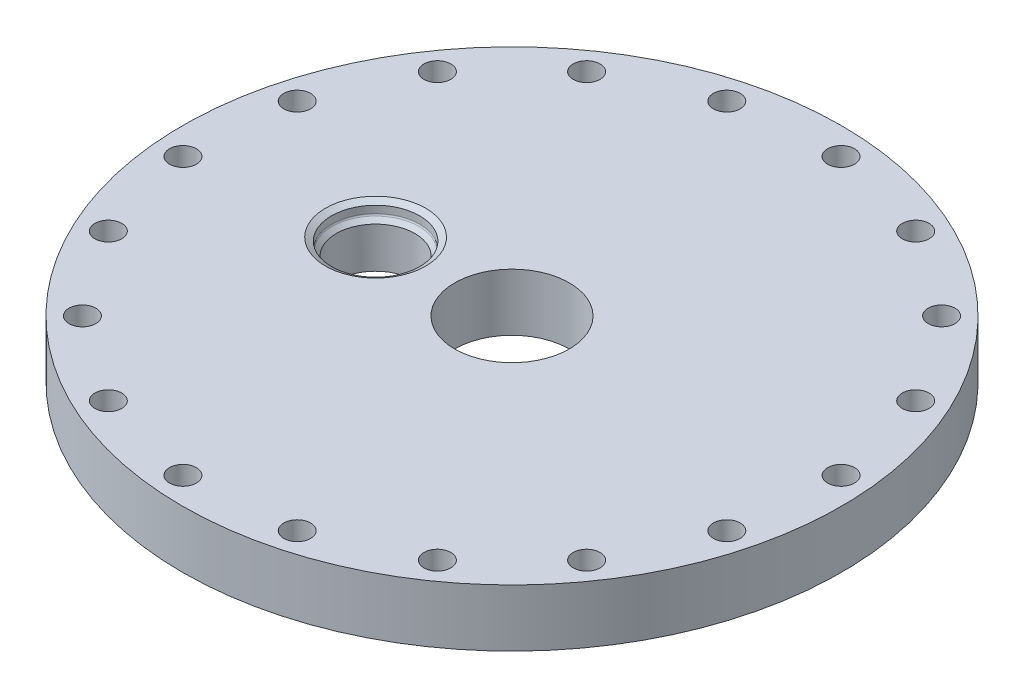
ISO-10303-21;
HEADER;
FILE_DESCRIPTION(('STEP AP214'),'2;1');
FILE_NAME('part.step','',(''),(''),'','','');
FILE_SCHEMA(('AUTOMOTIVE_DESIGN { 1 0 10303 214 1 1 1 1 }'));
ENDSEC;
DATA;
#1=APPLICATION_CONTEXT('core data for automotive mechanical design processes');
#2=APPLICATION_PROTOCOL_DEFINITION('international standard','automotive_design',2000,#1);
#3=PRODUCT_CONTEXT('',#1,'mechanical');
#4=PRODUCT('Part','Part','',(#3));
#5=PRODUCT_RELATED_PRODUCT_CATEGORY('part','',(#4));
#6=PRODUCT_DEFINITION_FORMATION('','',#4);
#7=PRODUCT_DEFINITION_CONTEXT('part definition',#1,'design');
#8=PRODUCT_DEFINITION('design','',#6,#7);
#9=PRODUCT_DEFINITION_SHAPE('','',#8);
#10=(LENGTH_UNIT() NAMED_UNIT(*) SI_UNIT(.MILLI.,.METRE.));
#11=(NAMED_UNIT(*) PLANE_ANGLE_UNIT() SI_UNIT($,.RADIAN.));
#12=(NAMED_UNIT(*) SI_UNIT($,.STERADIAN.) SOLID_ANGLE_UNIT());
#13=UNCERTAINTY_MEASURE_WITH_UNIT(LENGTH_MEASURE(1.E-05),#10,'distance_accuracy_value','');
#14=(GEOMETRIC_REPRESENTATION_CONTEXT(3) GLOBAL_UNCERTAINTY_ASSIGNED_CONTEXT((#13)) GLOBAL_UNIT_ASSIGNED_CONTEXT((#10,
#11,#12)) REPRESENTATION_CONTEXT('',''));
#15=CARTESIAN_POINT('',(0.,0.,0.));
#16=DIRECTION('',(0.,0.,1.));
#17=DIRECTION('',(1.,0.,0.));
#18=AXIS2_PLACEMENT_3D('',#15,#16,#17);
#19=CARTESIAN_POINT('',(-30.226,-0.000999999999999265,0.));
#20=DIRECTION('',(0.,1.,0.));
#21=DIRECTION('',(0.,0.,1.));
#22=AXIS2_PLACEMENT_3D('',#19,#20,#21);
#23=CYLINDRICAL_SURFACE('',#22,8.71220000000001);
#24=CARTESIAN_POINT('',(-30.226,0.,0.));
#25=DIRECTION('',(0.,1.,0.));
#26=DIRECTION('',(0.,0.,1.));
#27=AXIS2_PLACEMENT_3D('',#24,#25,#26);
#28=CIRCLE('',#27,8.71220000000001);
#29=CARTESIAN_POINT('',(-30.226,0.,8.71220000000001));
#30=VERTEX_POINT('',#29);
#31=EDGE_CURVE('E177',#30,#30,#28,.F.);
#32=ORIENTED_EDGE('',*,*,#31,.T.);
#33=EDGE_LOOP('',(#32));
#34=FACE_BOUND('',#33,.T.);
#35=CARTESIAN_POINT('',(-30.226,9.04787951031445,0.));
#36=DIRECTION('',(0.,-1.,0.));
#37=DIRECTION('',(0.,0.,-1.));
#38=AXIS2_PLACEMENT_3D('',#35,#36,#37);
#39=CIRCLE('',#38,8.71219999999999);
#40=CARTESIAN_POINT('',(-30.226,9.04787951031445,-8.71219999999999));
#41=VERTEX_POINT('',#40);
#42=EDGE_CURVE('E180',#41,#41,#39,.T.);
#43=ORIENTED_EDGE('',*,*,#42,.F.);
#44=EDGE_LOOP('',(#43));
#45=FACE_BOUND('',#44,.T.);
#46=ADVANCED_FACE('F41',(#34,#45),#23,.F.);
#47=CARTESIAN_POINT('',(0.,12.7,0.));
#48=DIRECTION('',(0.,-1.,0.));
#49=DIRECTION('',(0.,0.,-1.));
#50=AXIS2_PLACEMENT_3D('',#47,#48,#49);
#51=CYLINDRICAL_SURFACE('',#50,73.025);
#52=CARTESIAN_POINT('',(0.,12.7,0.));
#53=DIRECTION('',(0.,1.,0.));
#54=DIRECTION('',(0.,0.,1.));
#55=AXIS2_PLACEMENT_3D('',#52,#53,#54);
#56=CIRCLE('',#55,73.025);
#57=CARTESIAN_POINT('',(0.,12.7,73.025));
#58=VERTEX_POINT('',#57);
#59=EDGE_CURVE('E10',#58,#58,#56,.T.);
#60=ORIENTED_EDGE('',*,*,#59,.F.);
#61=EDGE_LOOP('',(#60));
#62=FACE_BOUND('',#61,.T.);
#63=CARTESIAN_POINT('',(0.,0.,0.));
#64=DIRECTION('',(0.,1.,0.));
#65=DIRECTION('',(0.,0.,1.));
#66=AXIS2_PLACEMENT_3D('',#63,#64,#65);
#67=CIRCLE('',#66,73.025);
#68=CARTESIAN_POINT('',(0.,0.,73.025));
#69=VERTEX_POINT('',#68);
#70=EDGE_CURVE('E45',#69,#69,#67,.T.);
#71=ORIENTED_EDGE('',*,*,#70,.T.);
#72=EDGE_LOOP('',(#71));
#73=FACE_BOUND('',#72,.T.);
#74=ADVANCED_FACE('F43',(#62,#73),#51,.T.);
#75=CARTESIAN_POINT('',(0.,12.7,0.));
#76=DIRECTION('',(0.,1.,0.));
#77=DIRECTION('',(0.,0.,1.));
#78=AXIS2_PLACEMENT_3D('',#75,#76,#77);
#79=PLANE('',#78);
#80=CARTESIAN_POINT('',(-30.226,12.7,0.));
#81=DIRECTION('',(0.,-1.,0.));
#82=DIRECTION('',(0.,0.,-1.));
#83=AXIS2_PLACEMENT_3D('',#80,#81,#82);
#84=CIRCLE('',#83,11.1125);
#85=CARTESIAN_POINT('',(-30.226,12.7,-11.1125));
#86=VERTEX_POINT('',#85);
#87=EDGE_CURVE('E192',#86,#86,#84,.T.);
#88=ORIENTED_EDGE('',*,*,#87,.T.);
#89=EDGE_LOOP('',(#88));
#90=FACE_BOUND('',#89,.T.);
#91=CARTESIAN_POINT('',(-67.0538651285555,12.7,5.86645304434398));
#92=DIRECTION('',(0.,1.,0.));
#93=DIRECTION('',(0.342020143325657,0.,0.939692620785913));
#94=AXIS2_PLACEMENT_3D('',#91,#92,#93);
#95=CIRCLE('',#94,2.97688);
#96=CARTESIAN_POINT('',(-66.0357122042922,12.7,8.66380521330915));
#97=VERTEX_POINT('',#96);
#98=EDGE_CURVE('E174',#97,#97,#95,.T.);
#99=ORIENTED_EDGE('',*,*,#98,.F.);
#100=EDGE_LOOP('',(#99));
#101=FACE_BOUND('',#100,.T.);
#102=CARTESIAN_POINT('',(-61.0035771454373,12.7,28.4464351977657));
#103=DIRECTION('',(0.,1.,0.));
#104=DIRECTION('',(0.64278760968653,0.,0.766044443118986));
#105=AXIS2_PLACEMENT_3D('',#102,#103,#104);
#106=CIRCLE('',#105,2.97688);
#107=CARTESIAN_POINT('',(-59.0900755659137,12.7,30.7268575795978));
#108=VERTEX_POINT('',#107);
#109=EDGE_CURVE('E166',#108,#108,#106,.T.);
#110=ORIENTED_EDGE('',*,*,#109,.F.);
#111=EDGE_LOOP('',(#110));
#112=FACE_BOUND('',#111,.T.);
#113=CARTESIAN_POINT('',(-47.5953574416671,12.7,47.5953574416659));
#114=DIRECTION('',(0.,1.,0.));
#115=DIRECTION('',(0.866025403784433,0.,0.50000000000001));
#116=AXIS2_PLACEMENT_3D('',#113,#114,#115);
#117=CIRCLE('',#116,2.97688);
#118=CARTESIAN_POINT('',(-45.0173037376493,12.7,49.083797441666));
#119=VERTEX_POINT('',#118);
#120=EDGE_CURVE('E159',#119,#119,#117,.T.);
#121=ORIENTED_EDGE('',*,*,#120,.F.);
#122=EDGE_LOOP('',(#121));
#123=FACE_BOUND('',#122,.T.);
#124=CARTESIAN_POINT('',(-28.4464351977671,12.7,61.0035771454366));
#125=DIRECTION('',(0.,1.,0.));
#126=DIRECTION('',(0.984807753012206,0.,0.17364817766694));
#127=AXIS2_PLACEMENT_3D('',#124,#125,#126);
#128=CIRCLE('',#127,2.97688);
#129=CARTESIAN_POINT('',(-25.5147806939802,12.7,61.5205069325698));
#130=VERTEX_POINT('',#129);
#131=EDGE_CURVE('E152',#130,#130,#128,.T.);
#132=ORIENTED_EDGE('',*,*,#131,.F.);
#133=EDGE_LOOP('',(#132));
#134=FACE_BOUND('',#133,.T.);
#135=CARTESIAN_POINT('',(-5.86645304434557,12.7,67.0538651285553));
#136=DIRECTION('',(0.,1.,0.));
#137=DIRECTION('',(0.98480775301221,0.,-0.173648177666921));
#138=AXIS2_PLACEMENT_3D('',#135,#136,#137);
#139=CIRCLE('',#138,2.97688);
#140=CARTESIAN_POINT('',(-2.93479854055859,12.7,66.5369353414222));
#141=VERTEX_POINT('',#140);
#142=EDGE_CURVE('E146',#141,#141,#139,.T.);
#143=ORIENTED_EDGE('',*,*,#142,.F.);
#144=EDGE_LOOP('',(#143));
#145=FACE_BOUND('',#144,.T.);
#146=CARTESIAN_POINT('',(17.42110992585,12.7,65.0164673675174));
#147=DIRECTION('',(0.,1.,0.));
#148=DIRECTION('',(0.866025403784443,0.,-0.499999999999992));
#149=AXIS2_PLACEMENT_3D('',#146,#147,#148);
#150=CIRCLE('',#149,2.97688);
#151=CARTESIAN_POINT('',(19.9991636298679,12.7,63.5280273675174));
#152=VERTEX_POINT('',#151);
#153=EDGE_CURVE('E140',#152,#152,#150,.T.);
#154=ORIENTED_EDGE('',*,*,#153,.F.);
#155=EDGE_LOOP('',(#154));
#156=FACE_BOUND('',#155,.T.);
#157=CARTESIAN_POINT('',(38.6074299307884,12.7,55.1371241010924));
#158=DIRECTION('',(0.,1.,0.));
#159=DIRECTION('',(0.642787609686546,0.,-0.766044443118973));
#160=AXIS2_PLACEMENT_3D('',#157,#158,#159);
#161=CIRCLE('',#160,2.97688);
#162=CARTESIAN_POINT('',(40.5209315103121,12.7,52.8567017192604));
#163=VERTEX_POINT('',#162);
#164=EDGE_CURVE('E134',#163,#163,#161,.T.);
#165=ORIENTED_EDGE('',*,*,#164,.F.);
#166=EDGE_LOOP('',(#165));
#167=FACE_BOUND('',#166,.T.);
#168=CARTESIAN_POINT('',(55.1371241010917,12.7,38.6074299307894));
#169=DIRECTION('',(0.,1.,0.));
#170=DIRECTION('',(0.342020143325676,0.,-0.939692620785906));
#171=AXIS2_PLACEMENT_3D('',#168,#169,#170);
#172=CIRCLE('',#171,2.97688);
#173=CARTESIAN_POINT('',(56.1552770253551,12.7,35.8100777618242));
#174=VERTEX_POINT('',#173);
#175=EDGE_CURVE('E128',#174,#174,#172,.T.);
#176=ORIENTED_EDGE('',*,*,#175,.F.);
#177=EDGE_LOOP('',(#176));
#178=FACE_BOUND('',#177,.T.);
#179=CARTESIAN_POINT('',(65.0164673675171,12.7,17.4211099258512));
#180=DIRECTION('',(0.,1.,0.));
#181=DIRECTION('',(0.,0.,-1.));
#182=AXIS2_PLACEMENT_3D('',#179,#180,#181);
#183=CIRCLE('',#182,2.97688);
#184=CARTESIAN_POINT('',(65.0164673675171,12.7,14.4442299258512));
#185=VERTEX_POINT('',#184);
#186=EDGE_CURVE('E122',#185,#185,#183,.T.);
#187=ORIENTED_EDGE('',*,*,#186,.F.);
#188=EDGE_LOOP('',(#187));
#189=FACE_BOUND('',#188,.T.);
#190=CARTESIAN_POINT('',(67.0538651285554,12.7,-5.86645304434442));
#191=DIRECTION('',(0.,1.,0.));
#192=DIRECTION('',(-0.342020143325663,0.,-0.939692620785911));
#193=AXIS2_PLACEMENT_3D('',#190,#191,#192);
#194=CIRCLE('',#193,2.97688);
#195=CARTESIAN_POINT('',(66.0357122042922,12.7,-8.66380521330959));
#196=VERTEX_POINT('',#195);
#197=EDGE_CURVE('E116',#196,#196,#194,.T.);
#198=ORIENTED_EDGE('',*,*,#197,.F.);
#199=EDGE_LOOP('',(#198));
#200=FACE_BOUND('',#199,.T.);
#201=CARTESIAN_POINT('',(61.0035771454371,12.7,-28.4464351977661));
#202=DIRECTION('',(0.,1.,0.));
#203=DIRECTION('',(-0.642787609686535,0.,-0.766044443118981));
#204=AXIS2_PLACEMENT_3D('',#201,#202,#203);
#205=CIRCLE('',#204,2.97688);
#206=CARTESIAN_POINT('',(59.0900755659134,12.7,-30.7268575795982));
#207=VERTEX_POINT('',#206);
#208=EDGE_CURVE('E110',#207,#207,#205,.T.);
#209=ORIENTED_EDGE('',*,*,#208,.F.);
#210=EDGE_LOOP('',(#209));
#211=FACE_BOUND('',#210,.T.);
#212=CARTESIAN_POINT('',(47.5953574416668,12.7,-47.5953574416663));
#213=DIRECTION('',(0.,1.,0.));
#214=DIRECTION('',(-0.866025403784436,0.,-0.500000000000004));
#215=AXIS2_PLACEMENT_3D('',#212,#213,#214);
#216=CIRCLE('',#215,2.97688);
#217=CARTESIAN_POINT('',(45.017303737649,12.7,-49.0837974416663));
#218=VERTEX_POINT('',#217);
#219=EDGE_CURVE('E104',#218,#218,#216,.T.);
#220=ORIENTED_EDGE('',*,*,#219,.F.);
#221=EDGE_LOOP('',(#220));
#222=FACE_BOUND('',#221,.T.);
#223=CARTESIAN_POINT('',(28.4464351977667,12.7,-61.0035771454368));
#224=DIRECTION('',(0.,1.,0.));
#225=DIRECTION('',(-0.984807753012207,0.,-0.173648177666934));
#226=AXIS2_PLACEMENT_3D('',#223,#224,#225);
#227=CIRCLE('',#226,2.97688);
#228=CARTESIAN_POINT('',(25.5147806939798,12.7,-61.5205069325699));
#229=VERTEX_POINT('',#228);
#230=EDGE_CURVE('E98',#229,#229,#227,.T.);
#231=ORIENTED_EDGE('',*,*,#230,.F.);
#232=EDGE_LOOP('',(#231));
#233=FACE_BOUND('',#232,.T.);
#234=CARTESIAN_POINT('',(5.86645304434512,12.7,-67.0538651285554));
#235=DIRECTION('',(0.,1.,0.));
#236=DIRECTION('',(-0.984807753012209,0.,0.173648177666927));
#237=AXIS2_PLACEMENT_3D('',#234,#235,#236);
#238=CIRCLE('',#237,2.97688);
#239=CARTESIAN_POINT('',(2.93479854055814,12.7,-66.5369353414223));
#240=VERTEX_POINT('',#239);
#241=EDGE_CURVE('E92',#240,#240,#238,.T.);
#242=ORIENTED_EDGE('',*,*,#241,.F.);
#243=EDGE_LOOP('',(#242));
#244=FACE_BOUND('',#243,.T.);
#245=CARTESIAN_POINT('',(-17.4211099258505,12.7,-65.0164673675173));
#246=DIRECTION('',(0.,1.,0.));
#247=DIRECTION('',(-0.86602540378444,0.,0.499999999999998));
#248=AXIS2_PLACEMENT_3D('',#245,#246,#247);
#249=CIRCLE('',#248,2.97688);
#250=CARTESIAN_POINT('',(-19.9991636298683,12.7,-63.5280273675173));
#251=VERTEX_POINT('',#250);
#252=EDGE_CURVE('E86',#251,#251,#249,.T.);
#253=ORIENTED_EDGE('',*,*,#252,.F.);
#254=EDGE_LOOP('',(#253));
#255=FACE_BOUND('',#254,.T.);
#256=CARTESIAN_POINT('',(-38.6074299307888,12.7,-55.1371241010921));
#257=DIRECTION('',(0.,1.,0.));
#258=DIRECTION('',(-0.642787609686541,0.,0.766044443118977));
#259=AXIS2_PLACEMENT_3D('',#256,#257,#258);
#260=CIRCLE('',#259,2.97688);
#261=CARTESIAN_POINT('',(-40.5209315103125,12.7,-52.8567017192601));
#262=VERTEX_POINT('',#261);
#263=EDGE_CURVE('E80',#262,#262,#260,.T.);
#264=ORIENTED_EDGE('',*,*,#263,.F.);
#265=EDGE_LOOP('',(#264));
#266=FACE_BOUND('',#265,.T.);
#267=CARTESIAN_POINT('',(-55.137124101092,12.7,-38.607429930789));
#268=DIRECTION('',(0.,1.,0.));
#269=DIRECTION('',(-0.342020143325669,0.,0.939692620785908));
#270=AXIS2_PLACEMENT_3D('',#267,#268,#269);
#271=CIRCLE('',#270,2.97688);
#272=CARTESIAN_POINT('',(-56.1552770253553,12.7,-35.8100777618238));
#273=VERTEX_POINT('',#272);
#274=EDGE_CURVE('E74',#273,#273,#271,.T.);
#275=ORIENTED_EDGE('',*,*,#274,.F.);
#276=EDGE_LOOP('',(#275));
#277=FACE_BOUND('',#276,.T.);
#278=CARTESIAN_POINT('',(-65.0164673675172,12.7,-17.4211099258507));
#279=DIRECTION('',(0.,1.,0.));
#280=DIRECTION('',(0.,0.,1.));
#281=AXIS2_PLACEMENT_3D('',#278,#279,#280);
#282=CIRCLE('',#281,2.97688);
#283=CARTESIAN_POINT('',(-65.0164673675172,12.7,-14.4442299258507));
#284=VERTEX_POINT('',#283);
#285=EDGE_CURVE('E68',#284,#284,#282,.T.);
#286=ORIENTED_EDGE('',*,*,#285,.F.);
#287=EDGE_LOOP('',(#286));
#288=FACE_BOUND('',#287,.T.);
#289=CARTESIAN_POINT('',(0.,12.7,0.));
#290=DIRECTION('',(0.,1.,0.));
#291=DIRECTION('',(0.,0.,1.));
#292=AXIS2_PLACEMENT_3D('',#289,#290,#291);
#293=CIRCLE('',#292,12.7);
#294=CARTESIAN_POINT('',(0.,12.7,12.7));
#295=VERTEX_POINT('',#294);
#296=EDGE_CURVE('E58',#295,#295,#293,.T.);
#297=ORIENTED_EDGE('',*,*,#296,.F.);
#298=EDGE_LOOP('',(#297));
#299=FACE_BOUND('',#298,.T.);
#300=ORIENTED_EDGE('',*,*,#59,.T.);
#301=EDGE_LOOP('',(#300));
#302=FACE_BOUND('',#301,.T.);
#303=ADVANCED_FACE('F197',(#90,#101,#112,#123,#134,#145,#156,#167,#178,#189,#200,#211,#222,#233,
#244,#255,#266,#277,#288,#299,#302),#79,.T.);
#304=CARTESIAN_POINT('',(0.,0.,0.));
#305=DIRECTION('',(0.,1.,0.));
#306=DIRECTION('',(0.,0.,1.));
#307=AXIS2_PLACEMENT_3D('',#304,#305,#306);
#308=PLANE('',#307);
#309=ORIENTED_EDGE('',*,*,#31,.F.);
#310=EDGE_LOOP('',(#309));
#311=FACE_BOUND('',#310,.T.);
#312=CARTESIAN_POINT('',(-67.0538651285555,0.,5.86645304434398));
#313=DIRECTION('',(0.,1.,0.));
#314=DIRECTION('',(0.,0.,1.));
#315=AXIS2_PLACEMENT_3D('',#312,#313,#314);
#316=CIRCLE('',#315,2.97688);
#317=CARTESIAN_POINT('',(-67.0538651285555,0.,8.84333304434399));
#318=VERTEX_POINT('',#317);
#319=EDGE_CURVE('E170',#318,#318,#316,.F.);
#320=ORIENTED_EDGE('',*,*,#319,.F.);
#321=EDGE_LOOP('',(#320));
#322=FACE_BOUND('',#321,.T.);
#323=CARTESIAN_POINT('',(-61.0035771454373,0.,28.4464351977657));
#324=DIRECTION('',(0.,1.,0.));
#325=DIRECTION('',(0.,0.,1.));
#326=AXIS2_PLACEMENT_3D('',#323,#324,#325);
#327=CIRCLE('',#326,2.97688);
#328=CARTESIAN_POINT('',(-61.0035771454373,0.,31.4233151977657));
#329=VERTEX_POINT('',#328);
#330=EDGE_CURVE('E163',#329,#329,#327,.F.);
#331=ORIENTED_EDGE('',*,*,#330,.F.);
#332=EDGE_LOOP('',(#331));
#333=FACE_BOUND('',#332,.T.);
#334=CARTESIAN_POINT('',(-47.5953574416671,0.,47.5953574416659));
#335=DIRECTION('',(0.,1.,0.));
#336=DIRECTION('',(0.,0.,1.));
#337=AXIS2_PLACEMENT_3D('',#334,#335,#336);
#338=CIRCLE('',#337,2.97688);
#339=CARTESIAN_POINT('',(-47.5953574416671,0.,50.5722374416659));
#340=VERTEX_POINT('',#339);
#341=EDGE_CURVE('E155',#340,#340,#338,.F.);
#342=ORIENTED_EDGE('',*,*,#341,.F.);
#343=EDGE_LOOP('',(#342));
#344=FACE_BOUND('',#343,.T.);
#345=CARTESIAN_POINT('',(-28.4464351977671,0.,61.0035771454366));
#346=DIRECTION('',(0.,1.,0.));
#347=DIRECTION('',(0.,0.,1.));
#348=AXIS2_PLACEMENT_3D('',#345,#346,#347);
#349=CIRCLE('',#348,2.97688);
#350=CARTESIAN_POINT('',(-28.4464351977671,0.,63.9804571454366));
#351=VERTEX_POINT('',#350);
#352=EDGE_CURVE('E149',#351,#351,#349,.F.);
#353=ORIENTED_EDGE('',*,*,#352,.F.);
#354=EDGE_LOOP('',(#353));
#355=FACE_BOUND('',#354,.T.);
#356=CARTESIAN_POINT('',(-5.86645304434557,0.,67.0538651285553));
#357=DIRECTION('',(0.,1.,0.));
#358=DIRECTION('',(0.,0.,1.));
#359=AXIS2_PLACEMENT_3D('',#356,#357,#358);
#360=CIRCLE('',#359,2.97688);
#361=CARTESIAN_POINT('',(-5.86645304434557,0.,70.0307451285553));
#362=VERTEX_POINT('',#361);
#363=EDGE_CURVE('E143',#362,#362,#360,.F.);
#364=ORIENTED_EDGE('',*,*,#363,.F.);
#365=EDGE_LOOP('',(#364));
#366=FACE_BOUND('',#365,.T.);
#367=CARTESIAN_POINT('',(17.42110992585,0.,65.0164673675174));
#368=DIRECTION('',(0.,1.,0.));
#369=DIRECTION('',(0.,0.,1.));
#370=AXIS2_PLACEMENT_3D('',#367,#368,#369);
#371=CIRCLE('',#370,2.97688);
#372=CARTESIAN_POINT('',(17.42110992585,0.,67.9933473675174));
#373=VERTEX_POINT('',#372);
#374=EDGE_CURVE('E137',#373,#373,#371,.F.);
#375=ORIENTED_EDGE('',*,*,#374,.F.);
#376=EDGE_LOOP('',(#375));
#377=FACE_BOUND('',#376,.T.);
#378=CARTESIAN_POINT('',(38.6074299307884,0.,55.1371241010924));
#379=DIRECTION('',(0.,1.,0.));
#380=DIRECTION('',(0.,0.,1.));
#381=AXIS2_PLACEMENT_3D('',#378,#379,#380);
#382=CIRCLE('',#381,2.97688);
#383=CARTESIAN_POINT('',(38.6074299307884,0.,58.1140041010924));
#384=VERTEX_POINT('',#383);
#385=EDGE_CURVE('E131',#384,#384,#382,.F.);
#386=ORIENTED_EDGE('',*,*,#385,.F.);
#387=EDGE_LOOP('',(#386));
#388=FACE_BOUND('',#387,.T.);
#389=CARTESIAN_POINT('',(55.1371241010917,0.,38.6074299307894));
#390=DIRECTION('',(0.,1.,0.));
#391=DIRECTION('',(0.,0.,1.));
#392=AXIS2_PLACEMENT_3D('',#389,#390,#391);
#393=CIRCLE('',#392,2.97688);
#394=CARTESIAN_POINT('',(55.1371241010917,0.,41.5843099307894));
#395=VERTEX_POINT('',#394);
#396=EDGE_CURVE('E125',#395,#395,#393,.F.);
#397=ORIENTED_EDGE('',*,*,#396,.F.);
#398=EDGE_LOOP('',(#397));
#399=FACE_BOUND('',#398,.T.);
#400=CARTESIAN_POINT('',(65.0164673675171,0.,17.4211099258512));
#401=DIRECTION('',(0.,1.,0.));
#402=DIRECTION('',(0.,0.,1.));
#403=AXIS2_PLACEMENT_3D('',#400,#401,#402);
#404=CIRCLE('',#403,2.97688);
#405=CARTESIAN_POINT('',(65.0164673675171,0.,20.3979899258512));
#406=VERTEX_POINT('',#405);
#407=EDGE_CURVE('E119',#406,#406,#404,.F.);
#408=ORIENTED_EDGE('',*,*,#407,.F.);
#409=EDGE_LOOP('',(#408));
#410=FACE_BOUND('',#409,.T.);
#411=CARTESIAN_POINT('',(67.0538651285554,0.,-5.86645304434442));
#412=DIRECTION('',(0.,1.,0.));
#413=DIRECTION('',(0.,0.,1.));
#414=AXIS2_PLACEMENT_3D('',#411,#412,#413);
#415=CIRCLE('',#414,2.97688);
#416=CARTESIAN_POINT('',(67.0538651285554,0.,-2.88957304434442));
#417=VERTEX_POINT('',#416);
#418=EDGE_CURVE('E113',#417,#417,#415,.F.);
#419=ORIENTED_EDGE('',*,*,#418,.F.);
#420=EDGE_LOOP('',(#419));
#421=FACE_BOUND('',#420,.T.);
#422=CARTESIAN_POINT('',(61.0035771454371,0.,-28.4464351977661));
#423=DIRECTION('',(0.,1.,0.));
#424=DIRECTION('',(0.,0.,1.));
#425=AXIS2_PLACEMENT_3D('',#422,#423,#424);
#426=CIRCLE('',#425,2.97688);
#427=CARTESIAN_POINT('',(61.0035771454371,0.,-25.4695551977661));
#428=VERTEX_POINT('',#427);
#429=EDGE_CURVE('E107',#428,#428,#426,.F.);
#430=ORIENTED_EDGE('',*,*,#429,.F.);
#431=EDGE_LOOP('',(#430));
#432=FACE_BOUND('',#431,.T.);
#433=CARTESIAN_POINT('',(47.5953574416668,0.,-47.5953574416663));
#434=DIRECTION('',(0.,1.,0.));
#435=DIRECTION('',(0.,0.,1.));
#436=AXIS2_PLACEMENT_3D('',#433,#434,#435);
#437=CIRCLE('',#436,2.97688);
#438=CARTESIAN_POINT('',(47.5953574416668,0.,-44.6184774416663));
#439=VERTEX_POINT('',#438);
#440=EDGE_CURVE('E101',#439,#439,#437,.F.);
#441=ORIENTED_EDGE('',*,*,#440,.F.);
#442=EDGE_LOOP('',(#441));
#443=FACE_BOUND('',#442,.T.);
#444=CARTESIAN_POINT('',(28.4464351977667,0.,-61.0035771454368));
#445=DIRECTION('',(0.,1.,0.));
#446=DIRECTION('',(0.,0.,1.));
#447=AXIS2_PLACEMENT_3D('',#444,#445,#446);
#448=CIRCLE('',#447,2.97688);
#449=CARTESIAN_POINT('',(28.4464351977667,0.,-58.0266971454368));
#450=VERTEX_POINT('',#449);
#451=EDGE_CURVE('E95',#450,#450,#448,.F.);
#452=ORIENTED_EDGE('',*,*,#451,.F.);
#453=EDGE_LOOP('',(#452));
#454=FACE_BOUND('',#453,.T.);
#455=CARTESIAN_POINT('',(5.86645304434512,0.,-67.0538651285554));
#456=DIRECTION('',(0.,1.,0.));
#457=DIRECTION('',(0.,0.,1.));
#458=AXIS2_PLACEMENT_3D('',#455,#456,#457);
#459=CIRCLE('',#458,2.97688);
#460=CARTESIAN_POINT('',(5.86645304434512,0.,-64.0769851285554));
#461=VERTEX_POINT('',#460);
#462=EDGE_CURVE('E89',#461,#461,#459,.F.);
#463=ORIENTED_EDGE('',*,*,#462,.F.);
#464=EDGE_LOOP('',(#463));
#465=FACE_BOUND('',#464,.T.);
#466=CARTESIAN_POINT('',(-17.4211099258505,0.,-65.0164673675173));
#467=DIRECTION('',(0.,1.,0.));
#468=DIRECTION('',(0.,0.,1.));
#469=AXIS2_PLACEMENT_3D('',#466,#467,#468);
#470=CIRCLE('',#469,2.97688);
#471=CARTESIAN_POINT('',(-17.4211099258505,0.,-62.0395873675172));
#472=VERTEX_POINT('',#471);
#473=EDGE_CURVE('E83',#472,#472,#470,.F.);
#474=ORIENTED_EDGE('',*,*,#473,.F.);
#475=EDGE_LOOP('',(#474));
#476=FACE_BOUND('',#475,.T.);
#477=CARTESIAN_POINT('',(-38.6074299307888,0.,-55.1371241010921));
#478=DIRECTION('',(0.,1.,0.));
#479=DIRECTION('',(0.,0.,1.));
#480=AXIS2_PLACEMENT_3D('',#477,#478,#479);
#481=CIRCLE('',#480,2.97688);
#482=CARTESIAN_POINT('',(-38.6074299307888,0.,-52.1602441010921));
#483=VERTEX_POINT('',#482);
#484=EDGE_CURVE('E77',#483,#483,#481,.F.);
#485=ORIENTED_EDGE('',*,*,#484,.F.);
#486=EDGE_LOOP('',(#485));
#487=FACE_BOUND('',#486,.T.);
#488=CARTESIAN_POINT('',(-55.137124101092,0.,-38.607429930789));
#489=DIRECTION('',(0.,1.,0.));
#490=DIRECTION('',(0.,0.,1.));
#491=AXIS2_PLACEMENT_3D('',#488,#489,#490);
#492=CIRCLE('',#491,2.97688);
#493=CARTESIAN_POINT('',(-55.137124101092,0.,-35.630549930789));
#494=VERTEX_POINT('',#493);
#495=EDGE_CURVE('E71',#494,#494,#492,.F.);
#496=ORIENTED_EDGE('',*,*,#495,.F.);
#497=EDGE_LOOP('',(#496));
#498=FACE_BOUND('',#497,.T.);
#499=CARTESIAN_POINT('',(-65.0164673675172,0.,-17.4211099258507));
#500=DIRECTION('',(0.,1.,0.));
#501=DIRECTION('',(0.,0.,1.));
#502=AXIS2_PLACEMENT_3D('',#499,#500,#501);
#503=CIRCLE('',#502,2.97688);
#504=CARTESIAN_POINT('',(-65.0164673675172,0.,-14.4442299258507));
#505=VERTEX_POINT('',#504);
#506=EDGE_CURVE('E62',#505,#505,#503,.F.);
#507=ORIENTED_EDGE('',*,*,#506,.F.);
#508=EDGE_LOOP('',(#507));
#509=FACE_BOUND('',#508,.T.);
#510=CARTESIAN_POINT('',(0.,0.,0.));
#511=DIRECTION('',(0.,1.,0.));
#512=DIRECTION('',(0.,0.,1.));
#513=AXIS2_PLACEMENT_3D('',#510,#511,#512);
#514=CIRCLE('',#513,12.7);
#515=CARTESIAN_POINT('',(0.,0.,12.7));
#516=VERTEX_POINT('',#515);
#517=EDGE_CURVE('E56',#516,#516,#514,.T.);
#518=ORIENTED_EDGE('',*,*,#517,.T.);
#519=EDGE_LOOP('',(#518));
#520=FACE_BOUND('',#519,.T.);
#521=ORIENTED_EDGE('',*,*,#70,.F.);
#522=EDGE_LOOP('',(#521));
#523=FACE_BOUND('',#522,.T.);
#524=ADVANCED_FACE('F298',(#311,#322,#333,#344,#355,#366,#377,#388,#399,#410,#421,#432,#443,
#454,#465,#476,#487,#498,#509,#520,#523),#308,.F.);
#525=CARTESIAN_POINT('',(0.,0.,0.));
#526=DIRECTION('',(0.,1.,0.));
#527=DIRECTION('',(0.,0.,1.));
#528=AXIS2_PLACEMENT_3D('',#525,#526,#527);
#529=CYLINDRICAL_SURFACE('',#528,12.7);
#530=ORIENTED_EDGE('',*,*,#517,.F.);
#531=EDGE_LOOP('',(#530));
#532=FACE_BOUND('',#531,.T.);
#533=ORIENTED_EDGE('',*,*,#296,.T.);
#534=EDGE_LOOP('',(#533));
#535=FACE_BOUND('',#534,.T.);
#536=ADVANCED_FACE('F294',(#532,#535),#529,.F.);
#537=CARTESIAN_POINT('',(-65.0164673675172,-0.000999999999999265,-17.4211099258507));
#538=DIRECTION('',(0.,1.,0.));
#539=DIRECTION('',(0.,0.,1.));
#540=AXIS2_PLACEMENT_3D('',#537,#538,#539);
#541=CYLINDRICAL_SURFACE('',#540,2.97688);
#542=ORIENTED_EDGE('',*,*,#285,.T.);
#543=EDGE_LOOP('',(#542));
#544=FACE_BOUND('',#543,.T.);
#545=ORIENTED_EDGE('',*,*,#506,.T.);
#546=EDGE_LOOP('',(#545));
#547=FACE_BOUND('',#546,.T.);
#548=ADVANCED_FACE('F290',(#544,#547),#541,.F.);
#549=CARTESIAN_POINT('',(-55.137124101092,-0.000999999999999265,-38.607429930789));
#550=DIRECTION('',(0.,1.,0.));
#551=DIRECTION('',(0.,0.,1.));
#552=AXIS2_PLACEMENT_3D('',#549,#550,#551);
#553=CYLINDRICAL_SURFACE('',#552,2.97688);
#554=ORIENTED_EDGE('',*,*,#274,.T.);
#555=EDGE_LOOP('',(#554));
#556=FACE_BOUND('',#555,.T.);
#557=ORIENTED_EDGE('',*,*,#495,.T.);
#558=EDGE_LOOP('',(#557));
#559=FACE_BOUND('',#558,.T.);
#560=ADVANCED_FACE('F286',(#556,#559),#553,.F.);
#561=CARTESIAN_POINT('',(-38.6074299307888,-0.000999999999999265,-55.1371241010921));
#562=DIRECTION('',(0.,1.,0.));
#563=DIRECTION('',(0.,0.,1.));
#564=AXIS2_PLACEMENT_3D('',#561,#562,#563);
#565=CYLINDRICAL_SURFACE('',#564,2.97688);
#566=ORIENTED_EDGE('',*,*,#263,.T.);
#567=EDGE_LOOP('',(#566));
#568=FACE_BOUND('',#567,.T.);
#569=ORIENTED_EDGE('',*,*,#484,.T.);
#570=EDGE_LOOP('',(#569));
#571=FACE_BOUND('',#570,.T.);
#572=ADVANCED_FACE('F282',(#568,#571),#565,.F.);
#573=CARTESIAN_POINT('',(-17.4211099258505,-0.000999999999999265,-65.0164673675173));
#574=DIRECTION('',(0.,1.,0.));
#575=DIRECTION('',(0.,0.,1.));
#576=AXIS2_PLACEMENT_3D('',#573,#574,#575);
#577=CYLINDRICAL_SURFACE('',#576,2.97688);
#578=ORIENTED_EDGE('',*,*,#252,.T.);
#579=EDGE_LOOP('',(#578));
#580=FACE_BOUND('',#579,.T.);
#581=ORIENTED_EDGE('',*,*,#473,.T.);
#582=EDGE_LOOP('',(#581));
#583=FACE_BOUND('',#582,.T.);
#584=ADVANCED_FACE('F278',(#580,#583),#577,.F.);
#585=CARTESIAN_POINT('',(5.86645304434512,-0.000999999999999265,-67.0538651285554));
#586=DIRECTION('',(0.,1.,0.));
#587=DIRECTION('',(0.,0.,1.));
#588=AXIS2_PLACEMENT_3D('',#585,#586,#587);
#589=CYLINDRICAL_SURFACE('',#588,2.97688);
#590=ORIENTED_EDGE('',*,*,#241,.T.);
#591=EDGE_LOOP('',(#590));
#592=FACE_BOUND('',#591,.T.);
#593=ORIENTED_EDGE('',*,*,#462,.T.);
#594=EDGE_LOOP('',(#593));
#595=FACE_BOUND('',#594,.T.);
#596=ADVANCED_FACE('F274',(#592,#595),#589,.F.);
#597=CARTESIAN_POINT('',(28.4464351977667,-0.000999999999999265,-61.0035771454368));
#598=DIRECTION('',(0.,1.,0.));
#599=DIRECTION('',(0.,0.,1.));
#600=AXIS2_PLACEMENT_3D('',#597,#598,#599);
#601=CYLINDRICAL_SURFACE('',#600,2.97688);
#602=ORIENTED_EDGE('',*,*,#230,.T.);
#603=EDGE_LOOP('',(#602));
#604=FACE_BOUND('',#603,.T.);
#605=ORIENTED_EDGE('',*,*,#451,.T.);
#606=EDGE_LOOP('',(#605));
#607=FACE_BOUND('',#606,.T.);
#608=ADVANCED_FACE('F270',(#604,#607),#601,.F.);
#609=CARTESIAN_POINT('',(47.5953574416668,-0.000999999999999265,-47.5953574416663));
#610=DIRECTION('',(0.,1.,0.));
#611=DIRECTION('',(0.,0.,1.));
#612=AXIS2_PLACEMENT_3D('',#609,#610,#611);
#613=CYLINDRICAL_SURFACE('',#612,2.97688);
#614=ORIENTED_EDGE('',*,*,#219,.T.);
#615=EDGE_LOOP('',(#614));
#616=FACE_BOUND('',#615,.T.);
#617=ORIENTED_EDGE('',*,*,#440,.T.);
#618=EDGE_LOOP('',(#617));
#619=FACE_BOUND('',#618,.T.);
#620=ADVANCED_FACE('F266',(#616,#619),#613,.F.);
#621=CARTESIAN_POINT('',(61.0035771454371,-0.000999999999999265,-28.4464351977661));
#622=DIRECTION('',(0.,1.,0.));
#623=DIRECTION('',(0.,0.,1.));
#624=AXIS2_PLACEMENT_3D('',#621,#622,#623);
#625=CYLINDRICAL_SURFACE('',#624,2.97688);
#626=ORIENTED_EDGE('',*,*,#208,.T.);
#627=EDGE_LOOP('',(#626));
#628=FACE_BOUND('',#627,.T.);
#629=ORIENTED_EDGE('',*,*,#429,.T.);
#630=EDGE_LOOP('',(#629));
#631=FACE_BOUND('',#630,.T.);
#632=ADVANCED_FACE('F262',(#628,#631),#625,.F.);
#633=CARTESIAN_POINT('',(67.0538651285554,-0.000999999999999265,-5.86645304434442));
#634=DIRECTION('',(0.,1.,0.));
#635=DIRECTION('',(0.,0.,1.));
#636=AXIS2_PLACEMENT_3D('',#633,#634,#635);
#637=CYLINDRICAL_SURFACE('',#636,2.97688);
#638=ORIENTED_EDGE('',*,*,#197,.T.);
#639=EDGE_LOOP('',(#638));
#640=FACE_BOUND('',#639,.T.);
#641=ORIENTED_EDGE('',*,*,#418,.T.);
#642=EDGE_LOOP('',(#641));
#643=FACE_BOUND('',#642,.T.);
#644=ADVANCED_FACE('F258',(#640,#643),#637,.F.);
#645=CARTESIAN_POINT('',(65.0164673675171,-0.000999999999999265,17.4211099258512));
#646=DIRECTION('',(0.,1.,0.));
#647=DIRECTION('',(0.,0.,1.));
#648=AXIS2_PLACEMENT_3D('',#645,#646,#647);
#649=CYLINDRICAL_SURFACE('',#648,2.97688);
#650=ORIENTED_EDGE('',*,*,#186,.T.);
#651=EDGE_LOOP('',(#650));
#652=FACE_BOUND('',#651,.T.);
#653=ORIENTED_EDGE('',*,*,#407,.T.);
#654=EDGE_LOOP('',(#653));
#655=FACE_BOUND('',#654,.T.);
#656=ADVANCED_FACE('F254',(#652,#655),#649,.F.);
#657=CARTESIAN_POINT('',(55.1371241010917,-0.000999999999999265,38.6074299307894));
#658=DIRECTION('',(0.,1.,0.));
#659=DIRECTION('',(0.,0.,1.));
#660=AXIS2_PLACEMENT_3D('',#657,#658,#659);
#661=CYLINDRICAL_SURFACE('',#660,2.97688);
#662=ORIENTED_EDGE('',*,*,#175,.T.);
#663=EDGE_LOOP('',(#662));
#664=FACE_BOUND('',#663,.T.);
#665=ORIENTED_EDGE('',*,*,#396,.T.);
#666=EDGE_LOOP('',(#665));
#667=FACE_BOUND('',#666,.T.);
#668=ADVANCED_FACE('F250',(#664,#667),#661,.F.);
#669=CARTESIAN_POINT('',(38.6074299307884,-0.000999999999999265,55.1371241010924));
#670=DIRECTION('',(0.,1.,0.));
#671=DIRECTION('',(0.,0.,1.));
#672=AXIS2_PLACEMENT_3D('',#669,#670,#671);
#673=CYLINDRICAL_SURFACE('',#672,2.97688);
#674=ORIENTED_EDGE('',*,*,#164,.T.);
#675=EDGE_LOOP('',(#674));
#676=FACE_BOUND('',#675,.T.);
#677=ORIENTED_EDGE('',*,*,#385,.T.);
#678=EDGE_LOOP('',(#677));
#679=FACE_BOUND('',#678,.T.);
#680=ADVANCED_FACE('F246',(#676,#679),#673,.F.);
#681=CARTESIAN_POINT('',(17.42110992585,-0.000999999999999265,65.0164673675174));
#682=DIRECTION('',(0.,1.,0.));
#683=DIRECTION('',(0.,0.,1.));
#684=AXIS2_PLACEMENT_3D('',#681,#682,#683);
#685=CYLINDRICAL_SURFACE('',#684,2.97688);
#686=ORIENTED_EDGE('',*,*,#153,.T.);
#687=EDGE_LOOP('',(#686));
#688=FACE_BOUND('',#687,.T.);
#689=ORIENTED_EDGE('',*,*,#374,.T.);
#690=EDGE_LOOP('',(#689));
#691=FACE_BOUND('',#690,.T.);
#692=ADVANCED_FACE('F242',(#688,#691),#685,.F.);
#693=CARTESIAN_POINT('',(-5.86645304434557,-0.000999999999999265,67.0538651285553));
#694=DIRECTION('',(0.,1.,0.));
#695=DIRECTION('',(0.,0.,1.));
#696=AXIS2_PLACEMENT_3D('',#693,#694,#695);
#697=CYLINDRICAL_SURFACE('',#696,2.97688);
#698=ORIENTED_EDGE('',*,*,#142,.T.);
#699=EDGE_LOOP('',(#698));
#700=FACE_BOUND('',#699,.T.);
#701=ORIENTED_EDGE('',*,*,#363,.T.);
#702=EDGE_LOOP('',(#701));
#703=FACE_BOUND('',#702,.T.);
#704=ADVANCED_FACE('F238',(#700,#703),#697,.F.);
#705=CARTESIAN_POINT('',(-28.4464351977671,-0.000999999999999265,61.0035771454366));
#706=DIRECTION('',(0.,1.,0.));
#707=DIRECTION('',(0.,0.,1.));
#708=AXIS2_PLACEMENT_3D('',#705,#706,#707);
#709=CYLINDRICAL_SURFACE('',#708,2.97688);
#710=ORIENTED_EDGE('',*,*,#131,.T.);
#711=EDGE_LOOP('',(#710));
#712=FACE_BOUND('',#711,.T.);
#713=ORIENTED_EDGE('',*,*,#352,.T.);
#714=EDGE_LOOP('',(#713));
#715=FACE_BOUND('',#714,.T.);
#716=ADVANCED_FACE('F234',(#712,#715),#709,.F.);
#717=CARTESIAN_POINT('',(-47.5953574416671,-0.000999999999999265,47.5953574416659));
#718=DIRECTION('',(0.,1.,0.));
#719=DIRECTION('',(0.,0.,1.));
#720=AXIS2_PLACEMENT_3D('',#717,#718,#719);
#721=CYLINDRICAL_SURFACE('',#720,2.97688);
#722=ORIENTED_EDGE('',*,*,#120,.T.);
#723=EDGE_LOOP('',(#722));
#724=FACE_BOUND('',#723,.T.);
#725=ORIENTED_EDGE('',*,*,#341,.T.);
#726=EDGE_LOOP('',(#725));
#727=FACE_BOUND('',#726,.T.);
#728=ADVANCED_FACE('F230',(#724,#727),#721,.F.);
#729=CARTESIAN_POINT('',(-61.0035771454373,-0.000999999999999265,28.4464351977657));
#730=DIRECTION('',(0.,1.,0.));
#731=DIRECTION('',(0.,0.,1.));
#732=AXIS2_PLACEMENT_3D('',#729,#730,#731);
#733=CYLINDRICAL_SURFACE('',#732,2.97688);
#734=ORIENTED_EDGE('',*,*,#109,.T.);
#735=EDGE_LOOP('',(#734));
#736=FACE_BOUND('',#735,.T.);
#737=ORIENTED_EDGE('',*,*,#330,.T.);
#738=EDGE_LOOP('',(#737));
#739=FACE_BOUND('',#738,.T.);
#740=ADVANCED_FACE('F226',(#736,#739),#733,.F.);
#741=CARTESIAN_POINT('',(-67.0538651285555,-0.000999999999999265,5.86645304434398));
#742=DIRECTION('',(0.,1.,0.));
#743=DIRECTION('',(0.,0.,1.));
#744=AXIS2_PLACEMENT_3D('',#741,#742,#743);
#745=CYLINDRICAL_SURFACE('',#744,2.97688);
#746=ORIENTED_EDGE('',*,*,#98,.T.);
#747=EDGE_LOOP('',(#746));
#748=FACE_BOUND('',#747,.T.);
#749=ORIENTED_EDGE('',*,*,#319,.T.);
#750=EDGE_LOOP('',(#749));
#751=FACE_BOUND('',#750,.T.);
#752=ADVANCED_FACE('F223',(#748,#751),#745,.F.);
#753=CARTESIAN_POINT('',(-30.226,9.95318975515723,0.));
#754=DIRECTION('',(0.,1.,0.));
#755=DIRECTION('',(0.,0.,1.));
#756=AXIS2_PLACEMENT_3D('',#753,#754,#755);
#757=CONICAL_SURFACE('',#756,9.61751024484274,0.785398163397429);
#758=ORIENTED_EDGE('',*,*,#42,.T.);
#759=EDGE_LOOP('',(#758));
#760=FACE_BOUND('',#759,.T.);
#761=CARTESIAN_POINT('',(-30.226,9.95318975515723,0.));
#762=DIRECTION('',(0.,-1.,0.));
#763=DIRECTION('',(0.,0.,-1.));
#764=AXIS2_PLACEMENT_3D('',#761,#762,#763);
#765=CIRCLE('',#764,9.61751024484274);
#766=CARTESIAN_POINT('',(-30.226,9.95318975515723,-9.61751024484274));
#767=VERTEX_POINT('',#766);
#768=EDGE_CURVE('E183',#767,#767,#765,.T.);
#769=ORIENTED_EDGE('',*,*,#768,.F.);
#770=EDGE_LOOP('',(#769));
#771=FACE_BOUND('',#770,.T.);
#772=ADVANCED_FACE('F221',(#760,#771),#757,.F.);
#773=CARTESIAN_POINT('',(-30.226,10.3124,0.));
#774=DIRECTION('',(0.,-1.,0.));
#775=DIRECTION('',(0.,0.,-1.));
#776=AXIS2_PLACEMENT_3D('',#773,#774,#775);
#777=TOROIDAL_SURFACE('',#776,9.25829999999998,0.507999999999997);
#778=ORIENTED_EDGE('',*,*,#768,.T.);
#779=EDGE_LOOP('',(#778));
#780=FACE_BOUND('',#779,.T.);
#781=CARTESIAN_POINT('',(-30.226,10.3124,0.));
#782=DIRECTION('',(0.,-1.,0.));
#783=DIRECTION('',(0.,0.,-1.));
#784=AXIS2_PLACEMENT_3D('',#781,#782,#783);
#785=CIRCLE('',#784,9.76629999999997);
#786=CARTESIAN_POINT('',(-30.226,10.3124,-9.76629999999997));
#787=VERTEX_POINT('',#786);
#788=EDGE_CURVE('E186',#787,#787,#785,.T.);
#789=ORIENTED_EDGE('',*,*,#788,.F.);
#790=EDGE_LOOP('',(#789));
#791=FACE_BOUND('',#790,.T.);
#792=ADVANCED_FACE('F208',(#780,#791),#777,.F.);
#793=CARTESIAN_POINT('',(-30.226,-7.46888199469763,0.));
#794=DIRECTION('',(0.,-1.,0.));
#795=DIRECTION('',(0.,0.,-1.));
#796=AXIS2_PLACEMENT_3D('',#793,#794,#795);
#797=CYLINDRICAL_SURFACE('',#796,9.76629999999998);
#798=ORIENTED_EDGE('',*,*,#788,.T.);
#799=EDGE_LOOP('',(#798));
#800=FACE_BOUND('',#799,.T.);
#801=CARTESIAN_POINT('',(-30.226,11.9227710676169,0.));
#802=DIRECTION('',(0.,-1.,0.));
#803=DIRECTION('',(0.,0.,-1.));
#804=AXIS2_PLACEMENT_3D('',#801,#802,#803);
#805=CIRCLE('',#804,9.76629999999998);
#806=CARTESIAN_POINT('',(-30.226,11.9227710676169,-9.76629999999998));
#807=VERTEX_POINT('',#806);
#808=EDGE_CURVE('E189',#807,#807,#805,.T.);
#809=ORIENTED_EDGE('',*,*,#808,.F.);
#810=EDGE_LOOP('',(#809));
#811=FACE_BOUND('',#810,.T.);
#812=ADVANCED_FACE('F202',(#800,#811),#797,.F.);
#813=CARTESIAN_POINT('',(-30.226,12.7,0.));
#814=DIRECTION('',(0.,1.,0.));
#815=DIRECTION('',(0.,0.,1.));
#816=AXIS2_PLACEMENT_3D('',#813,#814,#815);
#817=CONICAL_SURFACE('',#816,11.1125,1.0471975511966);
#818=ORIENTED_EDGE('',*,*,#808,.T.);
#819=EDGE_LOOP('',(#818));
#820=FACE_BOUND('',#819,.T.);
#821=ORIENTED_EDGE('',*,*,#87,.F.);
#822=EDGE_LOOP('',(#821));
#823=FACE_BOUND('',#822,.T.);
#824=ADVANCED_FACE('F200',(#820,#823),#817,.F.);
#825=CLOSED_SHELL('',(#46,#74,#303,#524,#536,#548,#560,#572,#584,#596,#608,#620,#632,#644,#656,
#668,#680,#692,#704,#716,#728,#740,#752,#772,#792,#812,#824));
#826=MANIFOLD_SOLID_BREP('B2',#825);
#827=ADVANCED_BREP_SHAPE_REPRESENTATION('',(#18,#826),#14);
#828=SHAPE_DEFINITION_REPRESENTATION(#9,#827);
ENDSEC;
END-ISO-10303-21;
